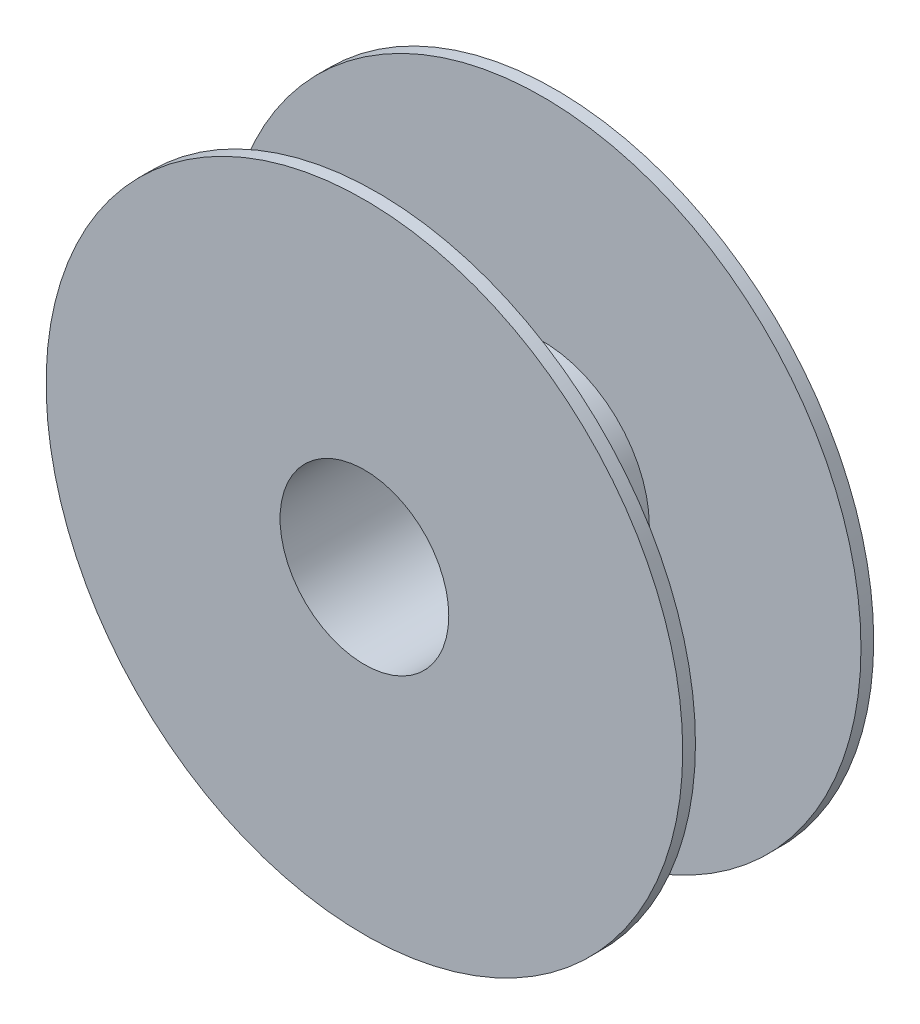
ISO-10303-21;
HEADER;
FILE_DESCRIPTION(('STEP AP214'),'2;1');
FILE_NAME('part.step','',(''),(''),'','','');
FILE_SCHEMA(('AUTOMOTIVE_DESIGN { 1 0 10303 214 1 1 1 1 }'));
ENDSEC;
DATA;
#1=APPLICATION_CONTEXT('core data for automotive mechanical design processes');
#2=APPLICATION_PROTOCOL_DEFINITION('international standard','automotive_design',2000,#1);
#3=PRODUCT_CONTEXT('',#1,'mechanical');
#4=PRODUCT('Part','Part','',(#3));
#5=PRODUCT_RELATED_PRODUCT_CATEGORY('part','',(#4));
#6=PRODUCT_DEFINITION_FORMATION('','',#4);
#7=PRODUCT_DEFINITION_CONTEXT('part definition',#1,'design');
#8=PRODUCT_DEFINITION('design','',#6,#7);
#9=PRODUCT_DEFINITION_SHAPE('','',#8);
#10=(LENGTH_UNIT() NAMED_UNIT(*) SI_UNIT(.MILLI.,.METRE.));
#11=(NAMED_UNIT(*) PLANE_ANGLE_UNIT() SI_UNIT($,.RADIAN.));
#12=(NAMED_UNIT(*) SI_UNIT($,.STERADIAN.) SOLID_ANGLE_UNIT());
#13=UNCERTAINTY_MEASURE_WITH_UNIT(LENGTH_MEASURE(1.E-05),#10,'distance_accuracy_value','');
#14=(GEOMETRIC_REPRESENTATION_CONTEXT(3) GLOBAL_UNCERTAINTY_ASSIGNED_CONTEXT((#13)) GLOBAL_UNIT_ASSIGNED_CONTEXT((#10,
#11,#12)) REPRESENTATION_CONTEXT('',''));
#15=CARTESIAN_POINT('',(0.,0.,0.));
#16=DIRECTION('',(0.,0.,1.));
#17=DIRECTION('',(1.,0.,0.));
#18=AXIS2_PLACEMENT_3D('',#15,#16,#17);
#19=CARTESIAN_POINT('',(0.,0.,30.));
#20=DIRECTION('',(0.,0.,-1.));
#21=DIRECTION('',(-1.,0.,0.));
#22=AXIS2_PLACEMENT_3D('',#19,#20,#21);
#23=CYLINDRICAL_SURFACE('',#22,100.);
#24=CARTESIAN_POINT('',(0.,0.,-30.));
#25=DIRECTION('',(0.,0.,1.));
#26=DIRECTION('',(1.,0.,0.));
#27=AXIS2_PLACEMENT_3D('',#24,#25,#26);
#28=CIRCLE('',#27,100.);
#29=CARTESIAN_POINT('',(100.,0.,-30.));
#30=VERTEX_POINT('',#29);
#31=EDGE_CURVE('E37',#30,#30,#28,.T.);
#32=ORIENTED_EDGE('',*,*,#31,.T.);
#33=EDGE_LOOP('',(#32));
#34=FACE_BOUND('',#33,.T.);
#35=CARTESIAN_POINT('',(0.,0.,-26.));
#36=DIRECTION('',(0.,0.,1.));
#37=DIRECTION('',(1.,0.,0.));
#38=AXIS2_PLACEMENT_3D('',#35,#36,#37);
#39=CIRCLE('',#38,100.);
#40=CARTESIAN_POINT('',(100.,0.,-26.));
#41=VERTEX_POINT('',#40);
#42=EDGE_CURVE('E50',#41,#41,#39,.T.);
#43=ORIENTED_EDGE('',*,*,#42,.F.);
#44=EDGE_LOOP('',(#43));
#45=FACE_BOUND('',#44,.T.);
#46=ADVANCED_FACE('F33',(#34,#45),#23,.T.);
#47=CARTESIAN_POINT('',(0.,0.,30.));
#48=DIRECTION('',(0.,0.,-1.));
#49=DIRECTION('',(-1.,0.,0.));
#50=AXIS2_PLACEMENT_3D('',#47,#48,#49);
#51=CYLINDRICAL_SURFACE('',#50,26.5);
#52=CARTESIAN_POINT('',(0.,0.,30.));
#53=DIRECTION('',(0.,0.,1.));
#54=DIRECTION('',(1.,0.,0.));
#55=AXIS2_PLACEMENT_3D('',#52,#53,#54);
#56=CIRCLE('',#55,26.5);
#57=CARTESIAN_POINT('',(26.5,0.,30.));
#58=VERTEX_POINT('',#57);
#59=EDGE_CURVE('E41',#58,#58,#56,.T.);
#60=ORIENTED_EDGE('',*,*,#59,.T.);
#61=EDGE_LOOP('',(#60));
#62=FACE_BOUND('',#61,.T.);
#63=CARTESIAN_POINT('',(0.,0.,-30.));
#64=DIRECTION('',(0.,0.,1.));
#65=DIRECTION('',(1.,0.,0.));
#66=AXIS2_PLACEMENT_3D('',#63,#64,#65);
#67=CIRCLE('',#66,26.5);
#68=CARTESIAN_POINT('',(26.5,0.,-30.));
#69=VERTEX_POINT('',#68);
#70=EDGE_CURVE('E48',#69,#69,#67,.T.);
#71=ORIENTED_EDGE('',*,*,#70,.F.);
#72=EDGE_LOOP('',(#71));
#73=FACE_BOUND('',#72,.T.);
#74=ADVANCED_FACE('F35',(#62,#73),#51,.F.);
#75=CARTESIAN_POINT('',(0.,0.,26.));
#76=DIRECTION('',(0.,0.,1.));
#77=DIRECTION('',(1.,0.,0.));
#78=AXIS2_PLACEMENT_3D('',#75,#76,#77);
#79=CIRCLE('',#78,100.);
#80=CARTESIAN_POINT('',(100.,0.,26.));
#81=VERTEX_POINT('',#80);
#82=EDGE_CURVE('E55',#81,#81,#79,.T.);
#83=ORIENTED_EDGE('',*,*,#82,.T.);
#84=EDGE_LOOP('',(#83));
#85=FACE_BOUND('',#84,.T.);
#86=CARTESIAN_POINT('',(0.,0.,30.));
#87=DIRECTION('',(0.,0.,1.));
#88=DIRECTION('',(1.,0.,0.));
#89=AXIS2_PLACEMENT_3D('',#86,#87,#88);
#90=CIRCLE('',#89,100.);
#91=CARTESIAN_POINT('',(100.,0.,30.));
#92=VERTEX_POINT('',#91);
#93=EDGE_CURVE('E10',#92,#92,#90,.T.);
#94=ORIENTED_EDGE('',*,*,#93,.F.);
#95=EDGE_LOOP('',(#94));
#96=FACE_BOUND('',#95,.T.);
#97=ADVANCED_FACE('F87',(#85,#96),#23,.T.);
#98=CARTESIAN_POINT('',(0.,0.,30.));
#99=DIRECTION('',(0.,0.,1.));
#100=DIRECTION('',(1.,0.,0.));
#101=AXIS2_PLACEMENT_3D('',#98,#99,#100);
#102=PLANE('',#101);
#103=ORIENTED_EDGE('',*,*,#59,.F.);
#104=EDGE_LOOP('',(#103));
#105=FACE_BOUND('',#104,.T.);
#106=ORIENTED_EDGE('',*,*,#93,.T.);
#107=EDGE_LOOP('',(#106));
#108=FACE_BOUND('',#107,.T.);
#109=ADVANCED_FACE('F82',(#105,#108),#102,.T.);
#110=CARTESIAN_POINT('',(0.,0.,-30.));
#111=DIRECTION('',(0.,0.,1.));
#112=DIRECTION('',(1.,0.,0.));
#113=AXIS2_PLACEMENT_3D('',#110,#111,#112);
#114=PLANE('',#113);
#115=ORIENTED_EDGE('',*,*,#70,.T.);
#116=EDGE_LOOP('',(#115));
#117=FACE_BOUND('',#116,.T.);
#118=ORIENTED_EDGE('',*,*,#31,.F.);
#119=EDGE_LOOP('',(#118));
#120=FACE_BOUND('',#119,.T.);
#121=ADVANCED_FACE('F74',(#117,#120),#114,.F.);
#122=CARTESIAN_POINT('',(0.,0.,-26.));
#123=DIRECTION('',(0.,0.,1.));
#124=DIRECTION('',(1.,0.,0.));
#125=AXIS2_PLACEMENT_3D('',#122,#123,#124);
#126=PLANE('',#125);
#127=CARTESIAN_POINT('',(0.,0.,-26.));
#128=DIRECTION('',(0.,0.,1.));
#129=DIRECTION('',(1.,0.,0.));
#130=AXIS2_PLACEMENT_3D('',#127,#128,#129);
#131=CIRCLE('',#130,33.5);
#132=CARTESIAN_POINT('',(33.5,0.,-26.));
#133=VERTEX_POINT('',#132);
#134=EDGE_CURVE('E60',#133,#133,#131,.T.);
#135=ORIENTED_EDGE('',*,*,#134,.F.);
#136=EDGE_LOOP('',(#135));
#137=FACE_BOUND('',#136,.T.);
#138=ORIENTED_EDGE('',*,*,#42,.T.);
#139=EDGE_LOOP('',(#138));
#140=FACE_BOUND('',#139,.T.);
#141=ADVANCED_FACE('F71',(#137,#140),#126,.T.);
#142=CARTESIAN_POINT('',(0.,0.,26.));
#143=DIRECTION('',(0.,0.,1.));
#144=DIRECTION('',(1.,0.,0.));
#145=AXIS2_PLACEMENT_3D('',#142,#143,#144);
#146=PLANE('',#145);
#147=CARTESIAN_POINT('',(0.,0.,26.));
#148=DIRECTION('',(0.,0.,1.));
#149=DIRECTION('',(1.,0.,0.));
#150=AXIS2_PLACEMENT_3D('',#147,#148,#149);
#151=CIRCLE('',#150,33.5);
#152=CARTESIAN_POINT('',(33.5,0.,26.));
#153=VERTEX_POINT('',#152);
#154=EDGE_CURVE('E62',#153,#153,#151,.T.);
#155=ORIENTED_EDGE('',*,*,#154,.T.);
#156=EDGE_LOOP('',(#155));
#157=FACE_BOUND('',#156,.T.);
#158=ORIENTED_EDGE('',*,*,#82,.F.);
#159=EDGE_LOOP('',(#158));
#160=FACE_BOUND('',#159,.T.);
#161=ADVANCED_FACE('F73',(#157,#160),#146,.F.);
#162=CARTESIAN_POINT('',(0.,0.,-26.));
#163=DIRECTION('',(0.,0.,1.));
#164=DIRECTION('',(1.,0.,0.));
#165=AXIS2_PLACEMENT_3D('',#162,#163,#164);
#166=CYLINDRICAL_SURFACE('',#165,33.5);
#167=ORIENTED_EDGE('',*,*,#134,.T.);
#168=EDGE_LOOP('',(#167));
#169=FACE_BOUND('',#168,.T.);
#170=ORIENTED_EDGE('',*,*,#154,.F.);
#171=EDGE_LOOP('',(#170));
#172=FACE_BOUND('',#171,.T.);
#173=ADVANCED_FACE('F68',(#169,#172),#166,.T.);
#174=CLOSED_SHELL('',(#46,#74,#97,#109,#121,#141,#161,#173));
#175=MANIFOLD_SOLID_BREP('B2',#174);
#176=ADVANCED_BREP_SHAPE_REPRESENTATION('',(#18,#175),#14);
#177=SHAPE_DEFINITION_REPRESENTATION(#9,#176);
ENDSEC;
END-ISO-10303-21;
